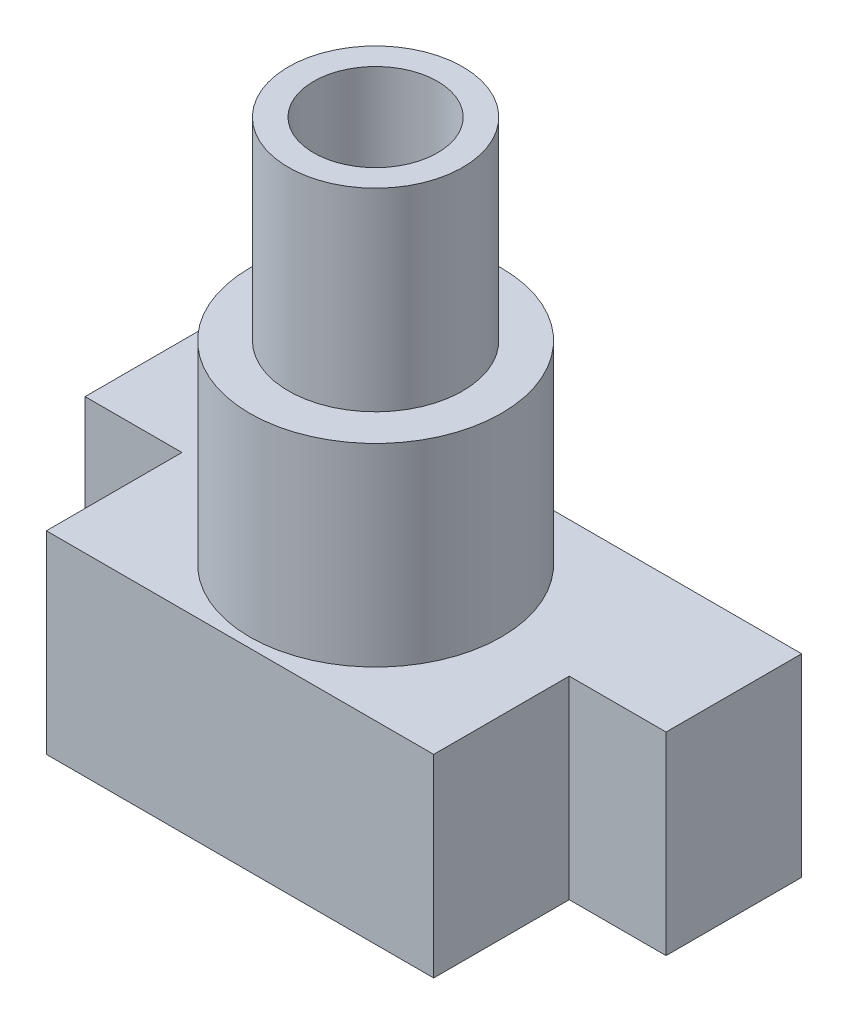
ISO-10303-21;
HEADER;
FILE_DESCRIPTION(('STEP AP214'),'2;1');
FILE_NAME('part.step','',(''),(''),'','','');
FILE_SCHEMA(('AUTOMOTIVE_DESIGN { 1 0 10303 214 1 1 1 1 }'));
ENDSEC;
DATA;
#1=APPLICATION_CONTEXT('core data for automotive mechanical design processes');
#2=APPLICATION_PROTOCOL_DEFINITION('international standard','automotive_design',2000,#1);
#3=PRODUCT_CONTEXT('',#1,'mechanical');
#4=PRODUCT('Part','Part','',(#3));
#5=PRODUCT_RELATED_PRODUCT_CATEGORY('part','',(#4));
#6=PRODUCT_DEFINITION_FORMATION('','',#4);
#7=PRODUCT_DEFINITION_CONTEXT('part definition',#1,'design');
#8=PRODUCT_DEFINITION('design','',#6,#7);
#9=PRODUCT_DEFINITION_SHAPE('','',#8);
#10=(LENGTH_UNIT() NAMED_UNIT(*) SI_UNIT(.MILLI.,.METRE.));
#11=(NAMED_UNIT(*) PLANE_ANGLE_UNIT() SI_UNIT($,.RADIAN.));
#12=(NAMED_UNIT(*) SI_UNIT($,.STERADIAN.) SOLID_ANGLE_UNIT());
#13=UNCERTAINTY_MEASURE_WITH_UNIT(LENGTH_MEASURE(1.E-05),#10,'distance_accuracy_value','');
#14=(GEOMETRIC_REPRESENTATION_CONTEXT(3) GLOBAL_UNCERTAINTY_ASSIGNED_CONTEXT((#13)) GLOBAL_UNIT_ASSIGNED_CONTEXT((#10,
#11,#12)) REPRESENTATION_CONTEXT('',''));
#15=CARTESIAN_POINT('',(0.,0.,0.));
#16=DIRECTION('',(0.,0.,1.));
#17=DIRECTION('',(1.,0.,0.));
#18=AXIS2_PLACEMENT_3D('',#15,#16,#17);
#19=CARTESIAN_POINT('',(-7.5,5.,-3.5));
#20=DIRECTION('',(0.,0.,1.));
#21=DIRECTION('',(1.,0.,0.));
#22=AXIS2_PLACEMENT_3D('',#19,#20,#21);
#23=PLANE('',#22);
#24=DIRECTION('',(-1.,0.,0.));
#25=VECTOR('',#24,1.);
#26=CARTESIAN_POINT('',(-7.5,0.,-3.5));
#27=LINE('',#26,#25);
#28=CARTESIAN_POINT('',(7.5,0.,-3.5));
#29=VERTEX_POINT('',#28);
#30=CARTESIAN_POINT('',(-7.5,0.,-3.5));
#31=VERTEX_POINT('',#30);
#32=EDGE_CURVE('E88',#29,#31,#27,.T.);
#33=ORIENTED_EDGE('',*,*,#32,.T.);
#34=DIRECTION('',(0.,-1.,0.));
#35=VECTOR('',#34,1.);
#36=CARTESIAN_POINT('',(-7.5,5.,-3.5));
#37=LINE('',#36,#35);
#38=CARTESIAN_POINT('',(-7.5,5.,-3.5));
#39=VERTEX_POINT('',#38);
#40=EDGE_CURVE('E11',#39,#31,#37,.T.);
#41=ORIENTED_EDGE('',*,*,#40,.F.);
#42=DIRECTION('',(-1.,0.,0.));
#43=VECTOR('',#42,1.);
#44=CARTESIAN_POINT('',(5.,5.,-3.5));
#45=LINE('',#44,#43);
#46=CARTESIAN_POINT('',(7.5,5.,-3.5));
#47=VERTEX_POINT('',#46);
#48=EDGE_CURVE('E94',#47,#39,#45,.T.);
#49=ORIENTED_EDGE('',*,*,#48,.F.);
#50=DIRECTION('',(0.,-1.,0.));
#51=VECTOR('',#50,1.);
#52=CARTESIAN_POINT('',(7.5,5.,-3.5));
#53=LINE('',#52,#51);
#54=EDGE_CURVE('E136',#47,#29,#53,.T.);
#55=ORIENTED_EDGE('',*,*,#54,.T.);
#56=EDGE_LOOP('',(#33,#41,#49,#55));
#57=FACE_BOUND('',#56,.T.);
#58=ADVANCED_FACE('F32',(#57),#23,.F.);
#59=CARTESIAN_POINT('',(-7.5,5.,0.));
#60=DIRECTION('',(1.,0.,0.));
#61=DIRECTION('',(0.,0.,-1.));
#62=AXIS2_PLACEMENT_3D('',#59,#60,#61);
#63=PLANE('',#62);
#64=DIRECTION('',(0.,0.,1.));
#65=VECTOR('',#64,1.);
#66=CARTESIAN_POINT('',(-7.5,0.,0.));
#67=LINE('',#66,#65);
#68=CARTESIAN_POINT('',(-7.5,0.,0.));
#69=VERTEX_POINT('',#68);
#70=EDGE_CURVE('E141',#31,#69,#67,.T.);
#71=ORIENTED_EDGE('',*,*,#70,.T.);
#72=DIRECTION('',(0.,-1.,0.));
#73=VECTOR('',#72,1.);
#74=CARTESIAN_POINT('',(-7.5,5.,0.));
#75=LINE('',#74,#73);
#76=CARTESIAN_POINT('',(-7.5,5.,0.));
#77=VERTEX_POINT('',#76);
#78=EDGE_CURVE('E39',#77,#69,#75,.T.);
#79=ORIENTED_EDGE('',*,*,#78,.F.);
#80=DIRECTION('',(0.,0.,1.));
#81=VECTOR('',#80,1.);
#82=CARTESIAN_POINT('',(-7.5,5.,0.));
#83=LINE('',#82,#81);
#84=EDGE_CURVE('E187',#39,#77,#83,.T.);
#85=ORIENTED_EDGE('',*,*,#84,.F.);
#86=ORIENTED_EDGE('',*,*,#40,.T.);
#87=EDGE_LOOP('',(#71,#79,#85,#86));
#88=FACE_BOUND('',#87,.T.);
#89=ADVANCED_FACE('F319',(#88),#63,.F.);
#90=CARTESIAN_POINT('',(-5.,5.,0.));
#91=DIRECTION('',(0.,0.,-1.));
#92=DIRECTION('',(-1.,0.,0.));
#93=AXIS2_PLACEMENT_3D('',#90,#91,#92);
#94=PLANE('',#93);
#95=DIRECTION('',(1.,0.,0.));
#96=VECTOR('',#95,1.);
#97=CARTESIAN_POINT('',(-5.,0.,0.));
#98=LINE('',#97,#96);
#99=CARTESIAN_POINT('',(-5.,0.,0.));
#100=VERTEX_POINT('',#99);
#101=EDGE_CURVE('E144',#69,#100,#98,.T.);
#102=ORIENTED_EDGE('',*,*,#101,.T.);
#103=DIRECTION('',(0.,-1.,0.));
#104=VECTOR('',#103,1.);
#105=CARTESIAN_POINT('',(-5.,5.,0.));
#106=LINE('',#105,#104);
#107=CARTESIAN_POINT('',(-5.,5.,0.));
#108=VERTEX_POINT('',#107);
#109=EDGE_CURVE('E162',#108,#100,#106,.T.);
#110=ORIENTED_EDGE('',*,*,#109,.F.);
#111=DIRECTION('',(1.,0.,0.));
#112=VECTOR('',#111,1.);
#113=CARTESIAN_POINT('',(-5.,5.,0.));
#114=LINE('',#113,#112);
#115=EDGE_CURVE('E171',#77,#108,#114,.T.);
#116=ORIENTED_EDGE('',*,*,#115,.F.);
#117=ORIENTED_EDGE('',*,*,#78,.T.);
#118=EDGE_LOOP('',(#102,#110,#116,#117));
#119=FACE_BOUND('',#118,.T.);
#120=ADVANCED_FACE('F169',(#119),#94,.F.);
#121=CARTESIAN_POINT('',(-5.,5.,3.5));
#122=DIRECTION('',(1.,0.,0.));
#123=DIRECTION('',(0.,0.,-1.));
#124=AXIS2_PLACEMENT_3D('',#121,#122,#123);
#125=PLANE('',#124);
#126=DIRECTION('',(0.,0.,1.));
#127=VECTOR('',#126,1.);
#128=CARTESIAN_POINT('',(-5.,0.,3.5));
#129=LINE('',#128,#127);
#130=CARTESIAN_POINT('',(-5.,0.,3.5));
#131=VERTEX_POINT('',#130);
#132=EDGE_CURVE('E146',#100,#131,#129,.T.);
#133=ORIENTED_EDGE('',*,*,#132,.T.);
#134=DIRECTION('',(0.,-1.,0.));
#135=VECTOR('',#134,1.);
#136=CARTESIAN_POINT('',(-5.,5.,3.5));
#137=LINE('',#136,#135);
#138=CARTESIAN_POINT('',(-5.,5.,3.5));
#139=VERTEX_POINT('',#138);
#140=EDGE_CURVE('E159',#139,#131,#137,.T.);
#141=ORIENTED_EDGE('',*,*,#140,.F.);
#142=DIRECTION('',(0.,0.,1.));
#143=VECTOR('',#142,1.);
#144=CARTESIAN_POINT('',(-5.,5.,3.5));
#145=LINE('',#144,#143);
#146=EDGE_CURVE('E183',#108,#139,#145,.T.);
#147=ORIENTED_EDGE('',*,*,#146,.F.);
#148=ORIENTED_EDGE('',*,*,#109,.T.);
#149=EDGE_LOOP('',(#133,#141,#147,#148));
#150=FACE_BOUND('',#149,.T.);
#151=ADVANCED_FACE('F179',(#150),#125,.F.);
#152=CARTESIAN_POINT('',(-5.,5.,3.5));
#153=DIRECTION('',(0.,0.,-1.));
#154=DIRECTION('',(-1.,0.,0.));
#155=AXIS2_PLACEMENT_3D('',#152,#153,#154);
#156=PLANE('',#155);
#157=DIRECTION('',(1.,0.,0.));
#158=VECTOR('',#157,1.);
#159=CARTESIAN_POINT('',(-5.,0.,3.5));
#160=LINE('',#159,#158);
#161=CARTESIAN_POINT('',(5.,0.,3.5));
#162=VERTEX_POINT('',#161);
#163=EDGE_CURVE('E148',#131,#162,#160,.T.);
#164=ORIENTED_EDGE('',*,*,#163,.T.);
#165=DIRECTION('',(0.,-1.,0.));
#166=VECTOR('',#165,1.);
#167=CARTESIAN_POINT('',(5.,5.,3.5));
#168=LINE('',#167,#166);
#169=CARTESIAN_POINT('',(5.,5.,3.5));
#170=VERTEX_POINT('',#169);
#171=EDGE_CURVE('E130',#170,#162,#168,.T.);
#172=ORIENTED_EDGE('',*,*,#171,.F.);
#173=DIRECTION('',(1.,0.,0.));
#174=VECTOR('',#173,1.);
#175=CARTESIAN_POINT('',(-5.,5.,3.5));
#176=LINE('',#175,#174);
#177=EDGE_CURVE('E118',#139,#170,#176,.T.);
#178=ORIENTED_EDGE('',*,*,#177,.F.);
#179=ORIENTED_EDGE('',*,*,#140,.T.);
#180=EDGE_LOOP('',(#164,#172,#178,#179));
#181=FACE_BOUND('',#180,.T.);
#182=ADVANCED_FACE('F182',(#181),#156,.F.);
#183=CARTESIAN_POINT('',(5.,5.,3.5));
#184=DIRECTION('',(-1.,0.,0.));
#185=DIRECTION('',(0.,0.,1.));
#186=AXIS2_PLACEMENT_3D('',#183,#184,#185);
#187=PLANE('',#186);
#188=DIRECTION('',(0.,0.,-1.));
#189=VECTOR('',#188,1.);
#190=CARTESIAN_POINT('',(5.,0.,3.5));
#191=LINE('',#190,#189);
#192=CARTESIAN_POINT('',(5.,0.,0.));
#193=VERTEX_POINT('',#192);
#194=EDGE_CURVE('E127',#162,#193,#191,.T.);
#195=ORIENTED_EDGE('',*,*,#194,.T.);
#196=DIRECTION('',(0.,-1.,0.));
#197=VECTOR('',#196,1.);
#198=CARTESIAN_POINT('',(5.,5.,0.));
#199=LINE('',#198,#197);
#200=CARTESIAN_POINT('',(5.,5.,0.));
#201=VERTEX_POINT('',#200);
#202=EDGE_CURVE('E124',#201,#193,#199,.T.);
#203=ORIENTED_EDGE('',*,*,#202,.F.);
#204=DIRECTION('',(0.,0.,-1.));
#205=VECTOR('',#204,1.);
#206=CARTESIAN_POINT('',(5.,5.,3.5));
#207=LINE('',#206,#205);
#208=EDGE_CURVE('E111',#170,#201,#207,.T.);
#209=ORIENTED_EDGE('',*,*,#208,.F.);
#210=ORIENTED_EDGE('',*,*,#171,.T.);
#211=EDGE_LOOP('',(#195,#203,#209,#210));
#212=FACE_BOUND('',#211,.T.);
#213=ADVANCED_FACE('F125',(#212),#187,.F.);
#214=CARTESIAN_POINT('',(7.5,5.,0.));
#215=DIRECTION('',(0.,0.,-1.));
#216=DIRECTION('',(-1.,0.,0.));
#217=AXIS2_PLACEMENT_3D('',#214,#215,#216);
#218=PLANE('',#217);
#219=DIRECTION('',(1.,0.,0.));
#220=VECTOR('',#219,1.);
#221=CARTESIAN_POINT('',(7.5,0.,0.));
#222=LINE('',#221,#220);
#223=CARTESIAN_POINT('',(7.5,0.,0.));
#224=VERTEX_POINT('',#223);
#225=EDGE_CURVE('E151',#193,#224,#222,.T.);
#226=ORIENTED_EDGE('',*,*,#225,.T.);
#227=DIRECTION('',(0.,-1.,0.));
#228=VECTOR('',#227,1.);
#229=CARTESIAN_POINT('',(7.5,5.,0.));
#230=LINE('',#229,#228);
#231=CARTESIAN_POINT('',(7.5,5.,0.));
#232=VERTEX_POINT('',#231);
#233=EDGE_CURVE('E131',#232,#224,#230,.T.);
#234=ORIENTED_EDGE('',*,*,#233,.F.);
#235=DIRECTION('',(1.,0.,0.));
#236=VECTOR('',#235,1.);
#237=CARTESIAN_POINT('',(7.5,5.,0.));
#238=LINE('',#237,#236);
#239=EDGE_CURVE('E115',#201,#232,#238,.T.);
#240=ORIENTED_EDGE('',*,*,#239,.F.);
#241=ORIENTED_EDGE('',*,*,#202,.T.);
#242=EDGE_LOOP('',(#226,#234,#240,#241));
#243=FACE_BOUND('',#242,.T.);
#244=ADVANCED_FACE('F133',(#243),#218,.F.);
#245=CARTESIAN_POINT('',(7.5,5.,-3.5));
#246=DIRECTION('',(-1.,0.,0.));
#247=DIRECTION('',(0.,0.,1.));
#248=AXIS2_PLACEMENT_3D('',#245,#246,#247);
#249=PLANE('',#248);
#250=DIRECTION('',(0.,0.,-1.));
#251=VECTOR('',#250,1.);
#252=CARTESIAN_POINT('',(7.5,0.,-3.5));
#253=LINE('',#252,#251);
#254=EDGE_CURVE('E153',#224,#29,#253,.T.);
#255=ORIENTED_EDGE('',*,*,#254,.T.);
#256=ORIENTED_EDGE('',*,*,#54,.F.);
#257=DIRECTION('',(0.,0.,-1.));
#258=VECTOR('',#257,1.);
#259=CARTESIAN_POINT('',(7.5,5.,-3.5));
#260=LINE('',#259,#258);
#261=EDGE_CURVE('E55',#232,#47,#260,.T.);
#262=ORIENTED_EDGE('',*,*,#261,.F.);
#263=ORIENTED_EDGE('',*,*,#233,.T.);
#264=EDGE_LOOP('',(#255,#256,#262,#263));
#265=FACE_BOUND('',#264,.T.);
#266=ADVANCED_FACE('F325',(#265),#249,.F.);
#267=CARTESIAN_POINT('',(0.,5.,0.));
#268=DIRECTION('',(0.,-1.,0.));
#269=DIRECTION('',(0.,0.,-1.));
#270=AXIS2_PLACEMENT_3D('',#267,#268,#269);
#271=PLANE('',#270);
#272=CARTESIAN_POINT('',(0.,5.,0.));
#273=DIRECTION('',(0.,-1.,0.));
#274=DIRECTION('',(0.,0.,-1.));
#275=AXIS2_PLACEMENT_3D('',#272,#273,#274);
#276=CIRCLE('',#275,3.25);
#277=CARTESIAN_POINT('',(0.,5.,-3.25));
#278=VERTEX_POINT('',#277);
#279=EDGE_CURVE('E251',#278,#278,#276,.T.);
#280=ORIENTED_EDGE('',*,*,#279,.T.);
#281=EDGE_LOOP('',(#280));
#282=FACE_BOUND('',#281,.T.);
#283=ORIENTED_EDGE('',*,*,#48,.T.);
#284=ORIENTED_EDGE('',*,*,#84,.T.);
#285=ORIENTED_EDGE('',*,*,#115,.T.);
#286=ORIENTED_EDGE('',*,*,#146,.T.);
#287=ORIENTED_EDGE('',*,*,#177,.T.);
#288=ORIENTED_EDGE('',*,*,#208,.T.);
#289=ORIENTED_EDGE('',*,*,#239,.T.);
#290=ORIENTED_EDGE('',*,*,#261,.T.);
#291=EDGE_LOOP('',(#283,#284,#285,#286,#287,#288,#289,#290));
#292=FACE_BOUND('',#291,.T.);
#293=ADVANCED_FACE('F113',(#282,#292),#271,.F.);
#294=CARTESIAN_POINT('',(0.,0.,0.));
#295=DIRECTION('',(0.,-1.,0.));
#296=DIRECTION('',(0.,0.,-1.));
#297=AXIS2_PLACEMENT_3D('',#294,#295,#296);
#298=PLANE('',#297);
#299=DIRECTION('',(0.5,0.,0.866025403784439));
#300=VECTOR('',#299,1.);
#301=CARTESIAN_POINT('',(1.58771324027147,0.,-2.75));
#302=LINE('',#301,#300);
#303=CARTESIAN_POINT('',(1.58771324027147,0.,-2.75));
#304=VERTEX_POINT('',#303);
#305=CARTESIAN_POINT('',(3.17542648054294,0.,0.));
#306=VERTEX_POINT('',#305);
#307=EDGE_CURVE('E46',#304,#306,#302,.T.);
#308=ORIENTED_EDGE('',*,*,#307,.F.);
#309=DIRECTION('',(1.,0.,0.));
#310=VECTOR('',#309,1.);
#311=CARTESIAN_POINT('',(-1.58771324027147,0.,-2.75));
#312=LINE('',#311,#310);
#313=CARTESIAN_POINT('',(-1.58771324027147,0.,-2.75));
#314=VERTEX_POINT('',#313);
#315=EDGE_CURVE('E206',#314,#304,#312,.T.);
#316=ORIENTED_EDGE('',*,*,#315,.F.);
#317=DIRECTION('',(0.5,0.,-0.866025403784438));
#318=VECTOR('',#317,1.);
#319=CARTESIAN_POINT('',(-3.17542648054294,0.,0.));
#320=LINE('',#319,#318);
#321=CARTESIAN_POINT('',(-3.17542648054294,0.,0.));
#322=VERTEX_POINT('',#321);
#323=EDGE_CURVE('E210',#322,#314,#320,.T.);
#324=ORIENTED_EDGE('',*,*,#323,.F.);
#325=DIRECTION('',(-0.5,0.,-0.866025403784438));
#326=VECTOR('',#325,1.);
#327=CARTESIAN_POINT('',(-1.58771324027147,0.,2.75));
#328=LINE('',#327,#326);
#329=CARTESIAN_POINT('',(-1.58771324027147,0.,2.75));
#330=VERTEX_POINT('',#329);
#331=EDGE_CURVE('E213',#330,#322,#328,.T.);
#332=ORIENTED_EDGE('',*,*,#331,.F.);
#333=DIRECTION('',(-1.,0.,0.));
#334=VECTOR('',#333,1.);
#335=CARTESIAN_POINT('',(1.58771324027147,0.,2.75));
#336=LINE('',#335,#334);
#337=CARTESIAN_POINT('',(1.58771324027147,0.,2.75));
#338=VERTEX_POINT('',#337);
#339=EDGE_CURVE('E216',#338,#330,#336,.T.);
#340=ORIENTED_EDGE('',*,*,#339,.F.);
#341=DIRECTION('',(-0.5,0.,0.866025403784438));
#342=VECTOR('',#341,1.);
#343=CARTESIAN_POINT('',(3.17542648054294,0.,0.));
#344=LINE('',#343,#342);
#345=EDGE_CURVE('E219',#306,#338,#344,.T.);
#346=ORIENTED_EDGE('',*,*,#345,.F.);
#347=EDGE_LOOP('',(#308,#316,#324,#332,#340,#346));
#348=FACE_BOUND('',#347,.T.);
#349=ORIENTED_EDGE('',*,*,#32,.F.);
#350=ORIENTED_EDGE('',*,*,#254,.F.);
#351=ORIENTED_EDGE('',*,*,#225,.F.);
#352=ORIENTED_EDGE('',*,*,#194,.F.);
#353=ORIENTED_EDGE('',*,*,#163,.F.);
#354=ORIENTED_EDGE('',*,*,#132,.F.);
#355=ORIENTED_EDGE('',*,*,#101,.F.);
#356=ORIENTED_EDGE('',*,*,#70,.F.);
#357=EDGE_LOOP('',(#349,#350,#351,#352,#353,#354,#355,#356));
#358=FACE_BOUND('',#357,.T.);
#359=ADVANCED_FACE('F175',(#348,#358),#298,.T.);
#360=CARTESIAN_POINT('',(1.58771324027147,2.5,-2.75));
#361=DIRECTION('',(0.866025403784439,0.,-0.5));
#362=DIRECTION('',(-0.5,0.,-0.866025403784439));
#363=AXIS2_PLACEMENT_3D('',#360,#361,#362);
#364=PLANE('',#363);
#365=ORIENTED_EDGE('',*,*,#307,.T.);
#366=DIRECTION('',(0.,-1.,0.));
#367=VECTOR('',#366,1.);
#368=CARTESIAN_POINT('',(3.17542648054294,2.5,0.));
#369=LINE('',#368,#367);
#370=CARTESIAN_POINT('',(3.17542648054294,2.5,0.));
#371=VERTEX_POINT('',#370);
#372=EDGE_CURVE('E190',#371,#306,#369,.T.);
#373=ORIENTED_EDGE('',*,*,#372,.F.);
#374=DIRECTION('',(0.5,0.,0.866025403784439));
#375=VECTOR('',#374,1.);
#376=CARTESIAN_POINT('',(1.58771324027147,2.5,-2.75));
#377=LINE('',#376,#375);
#378=CARTESIAN_POINT('',(1.58771324027147,2.5,-2.75));
#379=VERTEX_POINT('',#378);
#380=EDGE_CURVE('E209',#379,#371,#377,.T.);
#381=ORIENTED_EDGE('',*,*,#380,.F.);
#382=DIRECTION('',(0.,-1.,0.));
#383=VECTOR('',#382,1.);
#384=CARTESIAN_POINT('',(1.58771324027147,2.5,-2.75));
#385=LINE('',#384,#383);
#386=EDGE_CURVE('E142',#379,#304,#385,.T.);
#387=ORIENTED_EDGE('',*,*,#386,.T.);
#388=EDGE_LOOP('',(#365,#373,#381,#387));
#389=FACE_BOUND('',#388,.T.);
#390=ADVANCED_FACE('F271',(#389),#364,.F.);
#391=CARTESIAN_POINT('',(-1.58771324027147,2.5,-2.75));
#392=DIRECTION('',(0.,0.,-1.));
#393=DIRECTION('',(-1.,0.,0.));
#394=AXIS2_PLACEMENT_3D('',#391,#392,#393);
#395=PLANE('',#394);
#396=ORIENTED_EDGE('',*,*,#315,.T.);
#397=ORIENTED_EDGE('',*,*,#386,.F.);
#398=DIRECTION('',(1.,0.,0.));
#399=VECTOR('',#398,1.);
#400=CARTESIAN_POINT('',(-1.58771324027147,2.5,-2.75));
#401=LINE('',#400,#399);
#402=CARTESIAN_POINT('',(-1.58771324027147,2.5,-2.75));
#403=VERTEX_POINT('',#402);
#404=EDGE_CURVE('E193',#403,#379,#401,.T.);
#405=ORIENTED_EDGE('',*,*,#404,.F.);
#406=DIRECTION('',(0.,-1.,0.));
#407=VECTOR('',#406,1.);
#408=CARTESIAN_POINT('',(-1.58771324027147,2.5,-2.75));
#409=LINE('',#408,#407);
#410=EDGE_CURVE('E202',#403,#314,#409,.T.);
#411=ORIENTED_EDGE('',*,*,#410,.T.);
#412=EDGE_LOOP('',(#396,#397,#405,#411));
#413=FACE_BOUND('',#412,.T.);
#414=ADVANCED_FACE('F287',(#413),#395,.F.);
#415=CARTESIAN_POINT('',(-3.17542648054294,2.5,0.));
#416=DIRECTION('',(-0.866025403784439,0.,-0.5));
#417=DIRECTION('',(-0.5,0.,0.866025403784439));
#418=AXIS2_PLACEMENT_3D('',#415,#416,#417);
#419=PLANE('',#418);
#420=ORIENTED_EDGE('',*,*,#323,.T.);
#421=ORIENTED_EDGE('',*,*,#410,.F.);
#422=DIRECTION('',(0.5,0.,-0.866025403784438));
#423=VECTOR('',#422,1.);
#424=CARTESIAN_POINT('',(-3.17542648054294,2.5,0.));
#425=LINE('',#424,#423);
#426=CARTESIAN_POINT('',(-3.17542648054294,2.5,0.));
#427=VERTEX_POINT('',#426);
#428=EDGE_CURVE('E226',#427,#403,#425,.T.);
#429=ORIENTED_EDGE('',*,*,#428,.F.);
#430=DIRECTION('',(0.,-1.,0.));
#431=VECTOR('',#430,1.);
#432=CARTESIAN_POINT('',(-3.17542648054294,2.5,0.));
#433=LINE('',#432,#431);
#434=EDGE_CURVE('E199',#427,#322,#433,.T.);
#435=ORIENTED_EDGE('',*,*,#434,.T.);
#436=EDGE_LOOP('',(#420,#421,#429,#435));
#437=FACE_BOUND('',#436,.T.);
#438=ADVANCED_FACE('F292',(#437),#419,.F.);
#439=CARTESIAN_POINT('',(-1.58771324027147,2.5,2.75));
#440=DIRECTION('',(-0.866025403784439,0.,0.5));
#441=DIRECTION('',(0.5,0.,0.866025403784439));
#442=AXIS2_PLACEMENT_3D('',#439,#440,#441);
#443=PLANE('',#442);
#444=ORIENTED_EDGE('',*,*,#331,.T.);
#445=ORIENTED_EDGE('',*,*,#434,.F.);
#446=DIRECTION('',(-0.5,0.,-0.866025403784438));
#447=VECTOR('',#446,1.);
#448=CARTESIAN_POINT('',(-1.58771324027147,2.5,2.75));
#449=LINE('',#448,#447);
#450=CARTESIAN_POINT('',(-1.58771324027147,2.5,2.75));
#451=VERTEX_POINT('',#450);
#452=EDGE_CURVE('E229',#451,#427,#449,.T.);
#453=ORIENTED_EDGE('',*,*,#452,.F.);
#454=DIRECTION('',(0.,-1.,0.));
#455=VECTOR('',#454,1.);
#456=CARTESIAN_POINT('',(-1.58771324027147,2.5,2.75));
#457=LINE('',#456,#455);
#458=EDGE_CURVE('E196',#451,#330,#457,.T.);
#459=ORIENTED_EDGE('',*,*,#458,.T.);
#460=EDGE_LOOP('',(#444,#445,#453,#459));
#461=FACE_BOUND('',#460,.T.);
#462=ADVANCED_FACE('F309',(#461),#443,.F.);
#463=CARTESIAN_POINT('',(1.58771324027147,2.5,2.75));
#464=DIRECTION('',(0.,0.,1.));
#465=DIRECTION('',(1.,0.,0.));
#466=AXIS2_PLACEMENT_3D('',#463,#464,#465);
#467=PLANE('',#466);
#468=ORIENTED_EDGE('',*,*,#339,.T.);
#469=ORIENTED_EDGE('',*,*,#458,.F.);
#470=DIRECTION('',(-1.,0.,0.));
#471=VECTOR('',#470,1.);
#472=CARTESIAN_POINT('',(1.58771324027147,2.5,2.75));
#473=LINE('',#472,#471);
#474=CARTESIAN_POINT('',(1.58771324027147,2.5,2.75));
#475=VERTEX_POINT('',#474);
#476=EDGE_CURVE('E232',#475,#451,#473,.T.);
#477=ORIENTED_EDGE('',*,*,#476,.F.);
#478=DIRECTION('',(0.,-1.,0.));
#479=VECTOR('',#478,1.);
#480=CARTESIAN_POINT('',(1.58771324027147,2.5,2.75));
#481=LINE('',#480,#479);
#482=EDGE_CURVE('E192',#475,#338,#481,.T.);
#483=ORIENTED_EDGE('',*,*,#482,.T.);
#484=EDGE_LOOP('',(#468,#469,#477,#483));
#485=FACE_BOUND('',#484,.T.);
#486=ADVANCED_FACE('F305',(#485),#467,.F.);
#487=CARTESIAN_POINT('',(3.17542648054294,2.5,0.));
#488=DIRECTION('',(0.866025403784438,0.,0.5));
#489=DIRECTION('',(0.5,0.,-0.866025403784438));
#490=AXIS2_PLACEMENT_3D('',#487,#488,#489);
#491=PLANE('',#490);
#492=ORIENTED_EDGE('',*,*,#345,.T.);
#493=ORIENTED_EDGE('',*,*,#482,.F.);
#494=DIRECTION('',(-0.5,0.,0.866025403784438));
#495=VECTOR('',#494,1.);
#496=CARTESIAN_POINT('',(3.17542648054294,2.5,0.));
#497=LINE('',#496,#495);
#498=EDGE_CURVE('E235',#371,#475,#497,.T.);
#499=ORIENTED_EDGE('',*,*,#498,.F.);
#500=ORIENTED_EDGE('',*,*,#372,.T.);
#501=EDGE_LOOP('',(#492,#493,#499,#500));
#502=FACE_BOUND('',#501,.T.);
#503=ADVANCED_FACE('F263',(#502),#491,.F.);
#504=CARTESIAN_POINT('',(0.,2.5,0.));
#505=DIRECTION('',(0.,-1.,0.));
#506=DIRECTION('',(0.,0.,-1.));
#507=AXIS2_PLACEMENT_3D('',#504,#505,#506);
#508=PLANE('',#507);
#509=CARTESIAN_POINT('',(0.,2.5,0.));
#510=DIRECTION('',(0.,-1.,0.));
#511=DIRECTION('',(0.,0.,-1.));
#512=AXIS2_PLACEMENT_3D('',#509,#510,#511);
#513=CIRCLE('',#512,1.6);
#514=CARTESIAN_POINT('',(0.,2.5,-1.6));
#515=VERTEX_POINT('',#514);
#516=EDGE_CURVE('E254',#515,#515,#513,.T.);
#517=ORIENTED_EDGE('',*,*,#516,.F.);
#518=EDGE_LOOP('',(#517));
#519=FACE_BOUND('',#518,.T.);
#520=ORIENTED_EDGE('',*,*,#380,.T.);
#521=ORIENTED_EDGE('',*,*,#498,.T.);
#522=ORIENTED_EDGE('',*,*,#476,.T.);
#523=ORIENTED_EDGE('',*,*,#452,.T.);
#524=ORIENTED_EDGE('',*,*,#428,.T.);
#525=ORIENTED_EDGE('',*,*,#404,.T.);
#526=EDGE_LOOP('',(#520,#521,#522,#523,#524,#525));
#527=FACE_BOUND('',#526,.T.);
#528=ADVANCED_FACE('F260',(#519,#527),#508,.T.);
#529=CARTESIAN_POINT('',(0.,0.,0.));
#530=DIRECTION('',(0.,-1.,0.));
#531=DIRECTION('',(0.,0.,-1.));
#532=AXIS2_PLACEMENT_3D('',#529,#530,#531);
#533=CYLINDRICAL_SURFACE('',#532,1.6);
#534=CARTESIAN_POINT('',(0.,15.,0.));
#535=DIRECTION('',(0.,-1.,0.));
#536=DIRECTION('',(0.,0.,-1.));
#537=AXIS2_PLACEMENT_3D('',#534,#535,#536);
#538=CIRCLE('',#537,1.6);
#539=CARTESIAN_POINT('',(0.,15.,-1.6));
#540=VERTEX_POINT('',#539);
#541=EDGE_CURVE('E223',#540,#540,#538,.T.);
#542=ORIENTED_EDGE('',*,*,#541,.F.);
#543=EDGE_LOOP('',(#542));
#544=FACE_BOUND('',#543,.T.);
#545=ORIENTED_EDGE('',*,*,#516,.T.);
#546=EDGE_LOOP('',(#545));
#547=FACE_BOUND('',#546,.T.);
#548=ADVANCED_FACE('F258',(#544,#547),#533,.F.);
#549=CARTESIAN_POINT('',(1.6,15.,0.));
#550=DIRECTION('',(0.,1.,0.));
#551=DIRECTION('',(0.,0.,1.));
#552=AXIS2_PLACEMENT_3D('',#549,#550,#551);
#553=PLANE('',#552);
#554=ORIENTED_EDGE('',*,*,#541,.T.);
#555=EDGE_LOOP('',(#554));
#556=FACE_BOUND('',#555,.T.);
#557=CARTESIAN_POINT('',(0.,15.,0.));
#558=DIRECTION('',(0.,-1.,0.));
#559=DIRECTION('',(0.,0.,-1.));
#560=AXIS2_PLACEMENT_3D('',#557,#558,#559);
#561=CIRCLE('',#560,2.25);
#562=CARTESIAN_POINT('',(0.,15.,-2.25));
#563=VERTEX_POINT('',#562);
#564=EDGE_CURVE('E242',#563,#563,#561,.T.);
#565=ORIENTED_EDGE('',*,*,#564,.F.);
#566=EDGE_LOOP('',(#565));
#567=FACE_BOUND('',#566,.T.);
#568=ADVANCED_FACE('F427',(#556,#567),#553,.T.);
#569=CARTESIAN_POINT('',(0.,0.,0.));
#570=DIRECTION('',(0.,-1.,0.));
#571=DIRECTION('',(0.,0.,-1.));
#572=AXIS2_PLACEMENT_3D('',#569,#570,#571);
#573=CYLINDRICAL_SURFACE('',#572,2.25);
#574=ORIENTED_EDGE('',*,*,#564,.T.);
#575=EDGE_LOOP('',(#574));
#576=FACE_BOUND('',#575,.T.);
#577=CARTESIAN_POINT('',(0.,10.,0.));
#578=DIRECTION('',(0.,-1.,0.));
#579=DIRECTION('',(0.,0.,-1.));
#580=AXIS2_PLACEMENT_3D('',#577,#578,#579);
#581=CIRCLE('',#580,2.25);
#582=CARTESIAN_POINT('',(0.,10.,-2.25));
#583=VERTEX_POINT('',#582);
#584=EDGE_CURVE('E245',#583,#583,#581,.T.);
#585=ORIENTED_EDGE('',*,*,#584,.F.);
#586=EDGE_LOOP('',(#585));
#587=FACE_BOUND('',#586,.T.);
#588=ADVANCED_FACE('F432',(#576,#587),#573,.T.);
#589=CARTESIAN_POINT('',(2.25,10.,0.));
#590=DIRECTION('',(0.,1.,0.));
#591=DIRECTION('',(0.,0.,1.));
#592=AXIS2_PLACEMENT_3D('',#589,#590,#591);
#593=PLANE('',#592);
#594=ORIENTED_EDGE('',*,*,#584,.T.);
#595=EDGE_LOOP('',(#594));
#596=FACE_BOUND('',#595,.T.);
#597=CARTESIAN_POINT('',(0.,10.,0.));
#598=DIRECTION('',(0.,-1.,0.));
#599=DIRECTION('',(0.,0.,-1.));
#600=AXIS2_PLACEMENT_3D('',#597,#598,#599);
#601=CIRCLE('',#600,3.25);
#602=CARTESIAN_POINT('',(0.,10.,-3.25));
#603=VERTEX_POINT('',#602);
#604=EDGE_CURVE('E248',#603,#603,#601,.T.);
#605=ORIENTED_EDGE('',*,*,#604,.F.);
#606=EDGE_LOOP('',(#605));
#607=FACE_BOUND('',#606,.T.);
#608=ADVANCED_FACE('F444',(#596,#607),#593,.T.);
#609=CARTESIAN_POINT('',(0.,0.,0.));
#610=DIRECTION('',(0.,-1.,0.));
#611=DIRECTION('',(0.,0.,-1.));
#612=AXIS2_PLACEMENT_3D('',#609,#610,#611);
#613=CYLINDRICAL_SURFACE('',#612,3.25);
#614=ORIENTED_EDGE('',*,*,#604,.T.);
#615=EDGE_LOOP('',(#614));
#616=FACE_BOUND('',#615,.T.);
#617=ORIENTED_EDGE('',*,*,#279,.F.);
#618=EDGE_LOOP('',(#617));
#619=FACE_BOUND('',#618,.T.);
#620=ADVANCED_FACE('F454',(#616,#619),#613,.T.);
#621=CLOSED_SHELL('',(#58,#89,#120,#151,#182,#213,#244,#266,#293,#359,#390,#414,#438,#462,#486,
#503,#528,#548,#568,#588,#608,#620));
#622=MANIFOLD_SOLID_BREP('B2',#621);
#623=ADVANCED_BREP_SHAPE_REPRESENTATION('',(#18,#622),#14);
#624=SHAPE_DEFINITION_REPRESENTATION(#9,#623);
ENDSEC;
END-ISO-10303-21;
